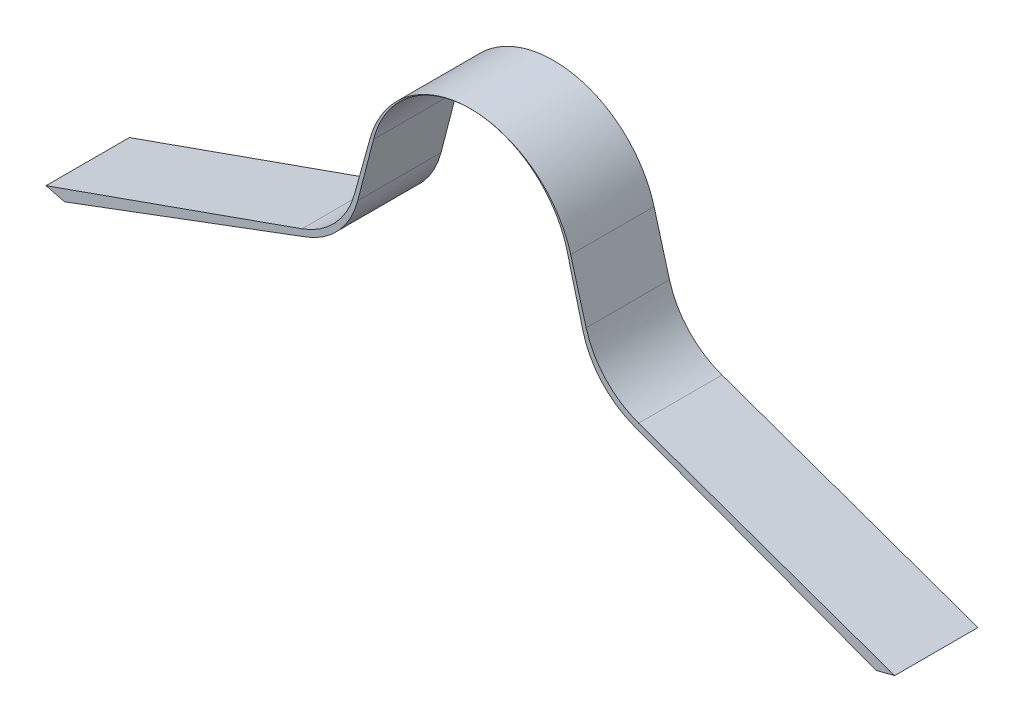
ISO-10303-21;
HEADER;
FILE_DESCRIPTION(('STEP AP214'),'2;1');
FILE_NAME('part.step','',(''),(''),'','','');
FILE_SCHEMA(('AUTOMOTIVE_DESIGN { 1 0 10303 214 1 1 1 1 }'));
ENDSEC;
DATA;
#1=APPLICATION_CONTEXT('core data for automotive mechanical design processes');
#2=APPLICATION_PROTOCOL_DEFINITION('international standard','automotive_design',2000,#1);
#3=PRODUCT_CONTEXT('',#1,'mechanical');
#4=PRODUCT('Part','Part','',(#3));
#5=PRODUCT_RELATED_PRODUCT_CATEGORY('part','',(#4));
#6=PRODUCT_DEFINITION_FORMATION('','',#4);
#7=PRODUCT_DEFINITION_CONTEXT('part definition',#1,'design');
#8=PRODUCT_DEFINITION('design','',#6,#7);
#9=PRODUCT_DEFINITION_SHAPE('','',#8);
#10=(LENGTH_UNIT() NAMED_UNIT(*) SI_UNIT(.MILLI.,.METRE.));
#11=(NAMED_UNIT(*) PLANE_ANGLE_UNIT() SI_UNIT($,.RADIAN.));
#12=(NAMED_UNIT(*) SI_UNIT($,.STERADIAN.) SOLID_ANGLE_UNIT());
#13=UNCERTAINTY_MEASURE_WITH_UNIT(LENGTH_MEASURE(1.E-05),#10,'distance_accuracy_value','');
#14=(GEOMETRIC_REPRESENTATION_CONTEXT(3) GLOBAL_UNCERTAINTY_ASSIGNED_CONTEXT((#13)) GLOBAL_UNIT_ASSIGNED_CONTEXT((#10,
#11,#12)) REPRESENTATION_CONTEXT('',''));
#15=CARTESIAN_POINT('',(0.,0.,0.));
#16=DIRECTION('',(0.,0.,1.));
#17=DIRECTION('',(1.,0.,0.));
#18=AXIS2_PLACEMENT_3D('',#15,#16,#17);
#19=CARTESIAN_POINT('',(-5.09125852276451,-1.06644045058442,1.));
#20=DIRECTION('',(0.246007151261733,0.969268013259535,0.));
#21=DIRECTION('',(-0.969268013259535,0.246007151261733,0.));
#22=AXIS2_PLACEMENT_3D('',#19,#20,#21);
#23=PLANE('',#22);
#24=DIRECTION('',(0.969268013259535,-0.246007151261733,0.));
#25=VECTOR('',#24,1.);
#26=CARTESIAN_POINT('',(-5.09125852276451,-1.06644045058442,0.));
#27=LINE('',#26,#25);
#28=CARTESIAN_POINT('',(-5.09125852276451,-1.06644045058442,0.));
#29=VERTEX_POINT('',#28);
#30=CARTESIAN_POINT('',(-4.86843377044591,-1.12299496574288,0.));
#31=VERTEX_POINT('',#30);
#32=EDGE_CURVE('E176',#29,#31,#27,.T.);
#33=ORIENTED_EDGE('',*,*,#32,.T.);
#34=DIRECTION('',(0.,0.,-1.));
#35=VECTOR('',#34,1.);
#36=CARTESIAN_POINT('',(-4.86843377044591,-1.12299496574288,1.));
#37=LINE('',#36,#35);
#38=CARTESIAN_POINT('',(-4.86843377044591,-1.12299496574288,1.));
#39=VERTEX_POINT('',#38);
#40=EDGE_CURVE('E11',#39,#31,#37,.T.);
#41=ORIENTED_EDGE('',*,*,#40,.F.);
#42=DIRECTION('',(0.969268013259535,-0.246007151261733,0.));
#43=VECTOR('',#42,1.);
#44=CARTESIAN_POINT('',(-5.09125852276451,-1.06644045058442,1.));
#45=LINE('',#44,#43);
#46=CARTESIAN_POINT('',(-5.09125852276451,-1.06644045058442,1.));
#47=VERTEX_POINT('',#46);
#48=EDGE_CURVE('E206',#47,#39,#45,.T.);
#49=ORIENTED_EDGE('',*,*,#48,.F.);
#50=DIRECTION('',(0.,0.,-1.));
#51=VECTOR('',#50,1.);
#52=CARTESIAN_POINT('',(-5.09125852276451,-1.06644045058442,1.));
#53=LINE('',#52,#51);
#54=EDGE_CURVE('E172',#47,#29,#53,.T.);
#55=ORIENTED_EDGE('',*,*,#54,.T.);
#56=EDGE_LOOP('',(#33,#41,#49,#55));
#57=FACE_BOUND('',#56,.T.);
#58=ADVANCED_FACE('F32',(#57),#23,.F.);
#59=CARTESIAN_POINT('',(-4.86843377044591,-1.12299496574288,1.));
#60=DIRECTION('',(-0.350207381259472,0.936672189248396,0.));
#61=DIRECTION('',(-0.936672189248396,-0.350207381259472,0.));
#62=AXIS2_PLACEMENT_3D('',#59,#60,#61);
#63=PLANE('',#62);
#64=DIRECTION('',(0.936672189248396,0.350207381259472,0.));
#65=VECTOR('',#64,1.);
#66=CARTESIAN_POINT('',(-4.86843377044591,-1.12299496574288,0.));
#67=LINE('',#66,#65);
#68=CARTESIAN_POINT('',(-1.96901480998741,-0.0389466370196774,0.));
#69=VERTEX_POINT('',#68);
#70=EDGE_CURVE('E179',#31,#69,#67,.T.);
#71=ORIENTED_EDGE('',*,*,#70,.T.);
#72=DIRECTION('',(0.,0.,-1.));
#73=VECTOR('',#72,1.);
#74=CARTESIAN_POINT('',(-1.96901480998741,-0.0389466370196774,1.));
#75=LINE('',#74,#73);
#76=CARTESIAN_POINT('',(-1.96901480998741,-0.0389466370196774,1.));
#77=VERTEX_POINT('',#76);
#78=EDGE_CURVE('E40',#77,#69,#75,.T.);
#79=ORIENTED_EDGE('',*,*,#78,.F.);
#80=DIRECTION('',(0.936672189248396,0.350207381259472,0.));
#81=VECTOR('',#80,1.);
#82=CARTESIAN_POINT('',(-4.86843377044591,-1.12299496574288,1.));
#83=LINE('',#82,#81);
#84=EDGE_CURVE('E115',#39,#77,#83,.T.);
#85=ORIENTED_EDGE('',*,*,#84,.F.);
#86=ORIENTED_EDGE('',*,*,#40,.T.);
#87=EDGE_LOOP('',(#71,#79,#85,#86));
#88=FACE_BOUND('',#87,.T.);
#89=ADVANCED_FACE('F304',(#88),#63,.F.);
#90=CARTESIAN_POINT('',(-2.31922219124688,0.897725552228719,1.));
#91=DIRECTION('',(0.,0.,-1.));
#92=DIRECTION('',(-1.,0.,0.));
#93=AXIS2_PLACEMENT_3D('',#90,#91,#92);
#94=CYLINDRICAL_SURFACE('',#93,1.);
#95=CARTESIAN_POINT('',(-2.31922219124688,0.897725552228719,0.));
#96=DIRECTION('',(0.,0.,1.));
#97=DIRECTION('',(-1.,0.,0.));
#98=AXIS2_PLACEMENT_3D('',#95,#96,#97);
#99=CIRCLE('',#98,1.);
#100=CARTESIAN_POINT('',(-1.35107455086877,0.647345548174284,0.));
#101=VERTEX_POINT('',#100);
#102=EDGE_CURVE('E181',#69,#101,#99,.T.);
#103=ORIENTED_EDGE('',*,*,#102,.T.);
#104=DIRECTION('',(0.,0.,-1.));
#105=VECTOR('',#104,1.);
#106=CARTESIAN_POINT('',(-1.35107455086877,0.647345548174284,1.));
#107=LINE('',#106,#105);
#108=CARTESIAN_POINT('',(-1.35107455086877,0.647345548174284,1.));
#109=VERTEX_POINT('',#108);
#110=EDGE_CURVE('E237',#109,#101,#107,.T.);
#111=ORIENTED_EDGE('',*,*,#110,.F.);
#112=CARTESIAN_POINT('',(-2.31922219124688,0.897725552228719,1.));
#113=DIRECTION('',(0.,0.,1.));
#114=DIRECTION('',(-1.,0.,0.));
#115=AXIS2_PLACEMENT_3D('',#112,#113,#114);
#116=CIRCLE('',#115,1.);
#117=EDGE_CURVE('E245',#77,#109,#116,.T.);
#118=ORIENTED_EDGE('',*,*,#117,.F.);
#119=ORIENTED_EDGE('',*,*,#78,.T.);
#120=EDGE_LOOP('',(#103,#111,#118,#119));
#121=FACE_BOUND('',#120,.T.);
#122=ADVANCED_FACE('F243',(#121),#94,.T.);
#123=CARTESIAN_POINT('',(-1.35107455086877,0.647345548174284,1.));
#124=DIRECTION('',(-0.968147640378109,0.250380004054435,0.));
#125=DIRECTION('',(-0.250380004054435,-0.96814764037811,0.));
#126=AXIS2_PLACEMENT_3D('',#123,#124,#125);
#127=PLANE('',#126);
#128=DIRECTION('',(0.250380004054435,0.96814764037811,0.));
#129=VECTOR('',#128,1.);
#130=CARTESIAN_POINT('',(-1.35107455086877,0.647345548174284,0.));
#131=LINE('',#130,#129);
#132=CARTESIAN_POINT('',(-1.16177716845373,1.3793042155886,0.));
#133=VERTEX_POINT('',#132);
#134=EDGE_CURVE('E183',#101,#133,#131,.T.);
#135=ORIENTED_EDGE('',*,*,#134,.T.);
#136=DIRECTION('',(0.,0.,-1.));
#137=VECTOR('',#136,1.);
#138=CARTESIAN_POINT('',(-1.16177716845373,1.3793042155886,1.));
#139=LINE('',#138,#137);
#140=CARTESIAN_POINT('',(-1.16177716845373,1.3793042155886,1.));
#141=VERTEX_POINT('',#140);
#142=EDGE_CURVE('E234',#141,#133,#139,.T.);
#143=ORIENTED_EDGE('',*,*,#142,.F.);
#144=DIRECTION('',(0.250380004054435,0.96814764037811,0.));
#145=VECTOR('',#144,1.);
#146=CARTESIAN_POINT('',(-1.35107455086877,0.647345548174284,1.));
#147=LINE('',#146,#145);
#148=EDGE_CURVE('E263',#109,#141,#147,.T.);
#149=ORIENTED_EDGE('',*,*,#148,.F.);
#150=ORIENTED_EDGE('',*,*,#110,.T.);
#151=EDGE_LOOP('',(#135,#143,#149,#150));
#152=FACE_BOUND('',#151,.T.);
#153=ADVANCED_FACE('F254',(#152),#127,.F.);
#154=CARTESIAN_POINT('',(0.,1.07884821072328,1.));
#155=DIRECTION('',(0.,0.,-1.));
#156=DIRECTION('',(-1.,0.,0.));
#157=AXIS2_PLACEMENT_3D('',#154,#155,#156);
#158=CYLINDRICAL_SURFACE('',#157,1.2);
#159=CARTESIAN_POINT('',(0.,1.07884821072328,0.));
#160=DIRECTION('',(0.,0.,-1.));
#161=DIRECTION('',(-1.,0.,0.));
#162=AXIS2_PLACEMENT_3D('',#159,#160,#161);
#163=CIRCLE('',#162,1.2);
#164=CARTESIAN_POINT('',(1.16177716845373,1.3793042155886,0.));
#165=VERTEX_POINT('',#164);
#166=EDGE_CURVE('E185',#133,#165,#163,.T.);
#167=ORIENTED_EDGE('',*,*,#166,.T.);
#168=DIRECTION('',(0.,0.,-1.));
#169=VECTOR('',#168,1.);
#170=CARTESIAN_POINT('',(1.16177716845373,1.3793042155886,1.));
#171=LINE('',#170,#169);
#172=CARTESIAN_POINT('',(1.16177716845373,1.3793042155886,1.));
#173=VERTEX_POINT('',#172);
#174=EDGE_CURVE('E231',#173,#165,#171,.T.);
#175=ORIENTED_EDGE('',*,*,#174,.F.);
#176=CARTESIAN_POINT('',(0.,1.07884821072328,1.));
#177=DIRECTION('',(0.,0.,-1.));
#178=DIRECTION('',(-1.,0.,0.));
#179=AXIS2_PLACEMENT_3D('',#176,#177,#178);
#180=CIRCLE('',#179,1.2);
#181=EDGE_CURVE('E260',#141,#173,#180,.T.);
#182=ORIENTED_EDGE('',*,*,#181,.F.);
#183=ORIENTED_EDGE('',*,*,#142,.T.);
#184=EDGE_LOOP('',(#167,#175,#182,#183));
#185=FACE_BOUND('',#184,.T.);
#186=ADVANCED_FACE('F258',(#185),#158,.F.);
#187=CARTESIAN_POINT('',(1.35107455086877,0.647345548174284,1.));
#188=DIRECTION('',(0.96814764037811,0.250380004054435,0.));
#189=DIRECTION('',(-0.250380004054435,0.96814764037811,0.));
#190=AXIS2_PLACEMENT_3D('',#187,#188,#189);
#191=PLANE('',#190);
#192=DIRECTION('',(0.250380004054435,-0.96814764037811,0.));
#193=VECTOR('',#192,1.);
#194=CARTESIAN_POINT('',(1.35107455086877,0.647345548174284,0.));
#195=LINE('',#194,#193);
#196=CARTESIAN_POINT('',(1.35107455086877,0.647345548174284,0.));
#197=VERTEX_POINT('',#196);
#198=EDGE_CURVE('E187',#165,#197,#195,.T.);
#199=ORIENTED_EDGE('',*,*,#198,.T.);
#200=DIRECTION('',(0.,0.,-1.));
#201=VECTOR('',#200,1.);
#202=CARTESIAN_POINT('',(1.35107455086877,0.647345548174284,1.));
#203=LINE('',#202,#201);
#204=CARTESIAN_POINT('',(1.35107455086877,0.647345548174284,1.));
#205=VERTEX_POINT('',#204);
#206=EDGE_CURVE('E228',#205,#197,#203,.T.);
#207=ORIENTED_EDGE('',*,*,#206,.F.);
#208=DIRECTION('',(0.250380004054435,-0.96814764037811,0.));
#209=VECTOR('',#208,1.);
#210=CARTESIAN_POINT('',(1.35107455086877,0.647345548174284,1.));
#211=LINE('',#210,#209);
#212=EDGE_CURVE('E262',#173,#205,#211,.T.);
#213=ORIENTED_EDGE('',*,*,#212,.F.);
#214=ORIENTED_EDGE('',*,*,#174,.T.);
#215=EDGE_LOOP('',(#199,#207,#213,#214));
#216=FACE_BOUND('',#215,.T.);
#217=ADVANCED_FACE('F317',(#216),#191,.F.);
#218=CARTESIAN_POINT('',(2.31922219124688,0.897725552228719,1.));
#219=DIRECTION('',(0.,0.,-1.));
#220=DIRECTION('',(-1.,0.,0.));
#221=AXIS2_PLACEMENT_3D('',#218,#219,#220);
#222=CYLINDRICAL_SURFACE('',#221,1.);
#223=CARTESIAN_POINT('',(2.31922219124688,0.897725552228719,0.));
#224=DIRECTION('',(0.,0.,1.));
#225=DIRECTION('',(1.,0.,0.));
#226=AXIS2_PLACEMENT_3D('',#223,#224,#225);
#227=CIRCLE('',#226,1.);
#228=CARTESIAN_POINT('',(1.96901480998741,-0.0389466370196772,0.));
#229=VERTEX_POINT('',#228);
#230=EDGE_CURVE('E189',#197,#229,#227,.T.);
#231=ORIENTED_EDGE('',*,*,#230,.T.);
#232=DIRECTION('',(0.,0.,-1.));
#233=VECTOR('',#232,1.);
#234=CARTESIAN_POINT('',(1.96901480998741,-0.0389466370196772,1.));
#235=LINE('',#234,#233);
#236=CARTESIAN_POINT('',(1.96901480998741,-0.0389466370196772,1.));
#237=VERTEX_POINT('',#236);
#238=EDGE_CURVE('E225',#237,#229,#235,.T.);
#239=ORIENTED_EDGE('',*,*,#238,.F.);
#240=CARTESIAN_POINT('',(2.31922219124688,0.897725552228719,1.));
#241=DIRECTION('',(0.,0.,1.));
#242=DIRECTION('',(1.,0.,0.));
#243=AXIS2_PLACEMENT_3D('',#240,#241,#242);
#244=CIRCLE('',#243,1.);
#245=EDGE_CURVE('E265',#205,#237,#244,.T.);
#246=ORIENTED_EDGE('',*,*,#245,.F.);
#247=ORIENTED_EDGE('',*,*,#206,.T.);
#248=EDGE_LOOP('',(#231,#239,#246,#247));
#249=FACE_BOUND('',#248,.T.);
#250=ADVANCED_FACE('F320',(#249),#222,.T.);
#251=CARTESIAN_POINT('',(4.86843377044591,-1.12299496574288,1.));
#252=DIRECTION('',(0.350207381259472,0.936672189248396,0.));
#253=DIRECTION('',(-0.936672189248396,0.350207381259472,0.));
#254=AXIS2_PLACEMENT_3D('',#251,#252,#253);
#255=PLANE('',#254);
#256=DIRECTION('',(0.936672189248396,-0.350207381259472,0.));
#257=VECTOR('',#256,1.);
#258=CARTESIAN_POINT('',(4.86843377044591,-1.12299496574288,0.));
#259=LINE('',#258,#257);
#260=CARTESIAN_POINT('',(4.86843377044591,-1.12299496574288,0.));
#261=VERTEX_POINT('',#260);
#262=EDGE_CURVE('E191',#229,#261,#259,.T.);
#263=ORIENTED_EDGE('',*,*,#262,.T.);
#264=DIRECTION('',(0.,0.,-1.));
#265=VECTOR('',#264,1.);
#266=CARTESIAN_POINT('',(4.86843377044591,-1.12299496574288,1.));
#267=LINE('',#266,#265);
#268=CARTESIAN_POINT('',(4.86843377044591,-1.12299496574288,1.));
#269=VERTEX_POINT('',#268);
#270=EDGE_CURVE('E222',#269,#261,#267,.T.);
#271=ORIENTED_EDGE('',*,*,#270,.F.);
#272=DIRECTION('',(0.936672189248396,-0.350207381259472,0.));
#273=VECTOR('',#272,1.);
#274=CARTESIAN_POINT('',(4.86843377044591,-1.12299496574288,1.));
#275=LINE('',#274,#273);
#276=EDGE_CURVE('E271',#237,#269,#275,.T.);
#277=ORIENTED_EDGE('',*,*,#276,.F.);
#278=ORIENTED_EDGE('',*,*,#238,.T.);
#279=EDGE_LOOP('',(#263,#271,#277,#278));
#280=FACE_BOUND('',#279,.T.);
#281=ADVANCED_FACE('F324',(#280),#255,.F.);
#282=CARTESIAN_POINT('',(5.09125852276451,-1.06644045058442,1.));
#283=DIRECTION('',(-0.246007151261736,0.969268013259535,0.));
#284=DIRECTION('',(-0.969268013259535,-0.246007151261736,0.));
#285=AXIS2_PLACEMENT_3D('',#282,#283,#284);
#286=PLANE('',#285);
#287=DIRECTION('',(0.969268013259534,0.246007151261736,0.));
#288=VECTOR('',#287,1.);
#289=CARTESIAN_POINT('',(5.09125852276451,-1.06644045058442,0.));
#290=LINE('',#289,#288);
#291=CARTESIAN_POINT('',(5.09125852276451,-1.06644045058442,0.));
#292=VERTEX_POINT('',#291);
#293=EDGE_CURVE('E193',#261,#292,#290,.T.);
#294=ORIENTED_EDGE('',*,*,#293,.T.);
#295=DIRECTION('',(0.,0.,-1.));
#296=VECTOR('',#295,1.);
#297=CARTESIAN_POINT('',(5.09125852276451,-1.06644045058442,1.));
#298=LINE('',#297,#296);
#299=CARTESIAN_POINT('',(5.09125852276451,-1.06644045058442,1.));
#300=VERTEX_POINT('',#299);
#301=EDGE_CURVE('E219',#300,#292,#298,.T.);
#302=ORIENTED_EDGE('',*,*,#301,.F.);
#303=DIRECTION('',(0.969268013259534,0.246007151261736,0.));
#304=VECTOR('',#303,1.);
#305=CARTESIAN_POINT('',(5.09125852276451,-1.06644045058442,1.));
#306=LINE('',#305,#304);
#307=EDGE_CURVE('E273',#269,#300,#306,.T.);
#308=ORIENTED_EDGE('',*,*,#307,.F.);
#309=ORIENTED_EDGE('',*,*,#270,.T.);
#310=EDGE_LOOP('',(#294,#302,#308,#309));
#311=FACE_BOUND('',#310,.T.);
#312=ADVANCED_FACE('F328',(#311),#286,.F.);
#313=CARTESIAN_POINT('',(5.09125852276451,-1.06644045058442,1.));
#314=DIRECTION('',(-0.333806859233775,-0.942641491092177,0.));
#315=DIRECTION('',(0.942641491092177,-0.333806859233775,0.));
#316=AXIS2_PLACEMENT_3D('',#313,#314,#315);
#317=PLANE('',#316);
#318=DIRECTION('',(-0.942641491092177,0.333806859233775,0.));
#319=VECTOR('',#318,1.);
#320=CARTESIAN_POINT('',(5.09125852276451,-1.06644045058442,0.));
#321=LINE('',#320,#319);
#322=CARTESIAN_POINT('',(2.01937068187544,0.0213720866056427,0.));
#323=VERTEX_POINT('',#322);
#324=EDGE_CURVE('E195',#292,#323,#321,.T.);
#325=ORIENTED_EDGE('',*,*,#324,.T.);
#326=DIRECTION('',(0.,0.,-1.));
#327=VECTOR('',#326,1.);
#328=CARTESIAN_POINT('',(2.01937068187544,0.0213720866056427,1.));
#329=LINE('',#328,#327);
#330=CARTESIAN_POINT('',(2.01937068187544,0.0213720866056427,1.));
#331=VERTEX_POINT('',#330);
#332=EDGE_CURVE('E216',#331,#323,#329,.T.);
#333=ORIENTED_EDGE('',*,*,#332,.F.);
#334=DIRECTION('',(-0.942641491092177,0.333806859233775,0.));
#335=VECTOR('',#334,1.);
#336=CARTESIAN_POINT('',(5.09125852276451,-1.06644045058442,1.));
#337=LINE('',#336,#335);
#338=EDGE_CURVE('E275',#300,#331,#337,.T.);
#339=ORIENTED_EDGE('',*,*,#338,.F.);
#340=ORIENTED_EDGE('',*,*,#301,.T.);
#341=EDGE_LOOP('',(#325,#333,#339,#340));
#342=FACE_BOUND('',#341,.T.);
#343=ADVANCED_FACE('F332',(#342),#317,.F.);
#344=CARTESIAN_POINT('',(2.35317754110922,0.96401357769782,1.));
#345=DIRECTION('',(0.,0.,-1.));
#346=DIRECTION('',(-1.,0.,0.));
#347=AXIS2_PLACEMENT_3D('',#344,#345,#346);
#348=CYLINDRICAL_SURFACE('',#347,1.);
#349=CARTESIAN_POINT('',(2.35317754110922,0.96401357769782,0.));
#350=DIRECTION('',(0.,0.,-1.));
#351=DIRECTION('',(1.,0.,0.));
#352=AXIS2_PLACEMENT_3D('',#349,#350,#351);
#353=CIRCLE('',#352,1.);
#354=CARTESIAN_POINT('',(1.38954708790059,0.69677520161957,0.));
#355=VERTEX_POINT('',#354);
#356=EDGE_CURVE('E197',#323,#355,#353,.T.);
#357=ORIENTED_EDGE('',*,*,#356,.T.);
#358=DIRECTION('',(0.,0.,-1.));
#359=VECTOR('',#358,1.);
#360=CARTESIAN_POINT('',(1.38954708790059,0.69677520161957,1.));
#361=LINE('',#360,#359);
#362=CARTESIAN_POINT('',(1.38954708790059,0.69677520161957,1.));
#363=VERTEX_POINT('',#362);
#364=EDGE_CURVE('E213',#363,#355,#361,.T.);
#365=ORIENTED_EDGE('',*,*,#364,.F.);
#366=CARTESIAN_POINT('',(2.35317754110922,0.96401357769782,1.));
#367=DIRECTION('',(0.,0.,-1.));
#368=DIRECTION('',(1.,0.,0.));
#369=AXIS2_PLACEMENT_3D('',#366,#367,#368);
#370=CIRCLE('',#369,1.);
#371=EDGE_CURVE('E277',#331,#363,#370,.T.);
#372=ORIENTED_EDGE('',*,*,#371,.F.);
#373=ORIENTED_EDGE('',*,*,#332,.T.);
#374=EDGE_LOOP('',(#357,#365,#372,#373));
#375=FACE_BOUND('',#374,.T.);
#376=ADVANCED_FACE('F336',(#375),#348,.F.);
#377=CARTESIAN_POINT('',(1.38954708790059,0.69677520161957,1.));
#378=DIRECTION('',(-0.963630453208625,-0.267238376078251,0.));
#379=DIRECTION('',(0.267238376078251,-0.963630453208625,0.));
#380=AXIS2_PLACEMENT_3D('',#377,#378,#379);
#381=PLANE('',#380);
#382=DIRECTION('',(-0.267238376078251,0.963630453208625,0.));
#383=VECTOR('',#382,1.);
#384=CARTESIAN_POINT('',(1.38954708790059,0.69677520161957,0.));
#385=LINE('',#384,#383);
#386=CARTESIAN_POINT('',(1.20453806651078,1.36389618082109,0.));
#387=VERTEX_POINT('',#386);
#388=EDGE_CURVE('E199',#355,#387,#385,.T.);
#389=ORIENTED_EDGE('',*,*,#388,.T.);
#390=DIRECTION('',(0.,0.,-1.));
#391=VECTOR('',#390,1.);
#392=CARTESIAN_POINT('',(1.20453806651078,1.36389618082109,1.));
#393=LINE('',#392,#391);
#394=CARTESIAN_POINT('',(1.20453806651078,1.36389618082109,1.));
#395=VERTEX_POINT('',#394);
#396=EDGE_CURVE('E210',#395,#387,#393,.T.);
#397=ORIENTED_EDGE('',*,*,#396,.F.);
#398=DIRECTION('',(-0.267238376078251,0.963630453208625,0.));
#399=VECTOR('',#398,1.);
#400=CARTESIAN_POINT('',(1.38954708790059,0.69677520161957,1.));
#401=LINE('',#400,#399);
#402=EDGE_CURVE('E279',#363,#395,#401,.T.);
#403=ORIENTED_EDGE('',*,*,#402,.F.);
#404=ORIENTED_EDGE('',*,*,#364,.T.);
#405=EDGE_LOOP('',(#389,#397,#403,#404));
#406=FACE_BOUND('',#405,.T.);
#407=ADVANCED_FACE('F285',(#406),#381,.F.);
#408=CARTESIAN_POINT('',(0.,1.02984821072328,1.));
#409=DIRECTION('',(0.,0.,-1.));
#410=DIRECTION('',(-1.,0.,0.));
#411=AXIS2_PLACEMENT_3D('',#408,#409,#410);
#412=CYLINDRICAL_SURFACE('',#411,1.25);
#413=CARTESIAN_POINT('',(0.,1.02984821072328,0.));
#414=DIRECTION('',(0.,0.,1.));
#415=DIRECTION('',(-1.,0.,0.));
#416=AXIS2_PLACEMENT_3D('',#413,#414,#415);
#417=CIRCLE('',#416,1.25);
#418=CARTESIAN_POINT('',(-1.20453806651078,1.36389618082109,0.));
#419=VERTEX_POINT('',#418);
#420=EDGE_CURVE('E201',#387,#419,#417,.T.);
#421=ORIENTED_EDGE('',*,*,#420,.T.);
#422=DIRECTION('',(0.,0.,-1.));
#423=VECTOR('',#422,1.);
#424=CARTESIAN_POINT('',(-1.20453806651078,1.36389618082109,1.));
#425=LINE('',#424,#423);
#426=CARTESIAN_POINT('',(-1.20453806651078,1.36389618082109,1.));
#427=VERTEX_POINT('',#426);
#428=EDGE_CURVE('E167',#427,#419,#425,.T.);
#429=ORIENTED_EDGE('',*,*,#428,.F.);
#430=CARTESIAN_POINT('',(0.,1.02984821072328,1.));
#431=DIRECTION('',(0.,0.,1.));
#432=DIRECTION('',(-1.,0.,0.));
#433=AXIS2_PLACEMENT_3D('',#430,#431,#432);
#434=CIRCLE('',#433,1.25);
#435=EDGE_CURVE('E158',#395,#427,#434,.T.);
#436=ORIENTED_EDGE('',*,*,#435,.F.);
#437=ORIENTED_EDGE('',*,*,#396,.T.);
#438=EDGE_LOOP('',(#421,#429,#436,#437));
#439=FACE_BOUND('',#438,.T.);
#440=ADVANCED_FACE('F289',(#439),#412,.T.);
#441=CARTESIAN_POINT('',(-1.38954708790059,0.696775201619569,1.));
#442=DIRECTION('',(0.963630453208625,-0.267238376078251,0.));
#443=DIRECTION('',(0.267238376078251,0.963630453208625,0.));
#444=AXIS2_PLACEMENT_3D('',#441,#442,#443);
#445=PLANE('',#444);
#446=DIRECTION('',(-0.267238376078251,-0.963630453208625,0.));
#447=VECTOR('',#446,1.);
#448=CARTESIAN_POINT('',(-1.38954708790059,0.696775201619569,0.));
#449=LINE('',#448,#447);
#450=CARTESIAN_POINT('',(-1.38954708790059,0.696775201619569,0.));
#451=VERTEX_POINT('',#450);
#452=EDGE_CURVE('E166',#419,#451,#449,.T.);
#453=ORIENTED_EDGE('',*,*,#452,.T.);
#454=DIRECTION('',(0.,0.,-1.));
#455=VECTOR('',#454,1.);
#456=CARTESIAN_POINT('',(-1.38954708790059,0.696775201619569,1.));
#457=LINE('',#456,#455);
#458=CARTESIAN_POINT('',(-1.38954708790059,0.696775201619569,1.));
#459=VERTEX_POINT('',#458);
#460=EDGE_CURVE('E163',#459,#451,#457,.T.);
#461=ORIENTED_EDGE('',*,*,#460,.F.);
#462=DIRECTION('',(-0.267238376078251,-0.963630453208625,0.));
#463=VECTOR('',#462,1.);
#464=CARTESIAN_POINT('',(-1.38954708790059,0.696775201619569,1.));
#465=LINE('',#464,#463);
#466=EDGE_CURVE('E152',#427,#459,#465,.T.);
#467=ORIENTED_EDGE('',*,*,#466,.F.);
#468=ORIENTED_EDGE('',*,*,#428,.T.);
#469=EDGE_LOOP('',(#453,#461,#467,#468));
#470=FACE_BOUND('',#469,.T.);
#471=ADVANCED_FACE('F164',(#470),#445,.F.);
#472=CARTESIAN_POINT('',(-2.35317754110921,0.964013577697819,1.));
#473=DIRECTION('',(0.,0.,-1.));
#474=DIRECTION('',(-1.,0.,0.));
#475=AXIS2_PLACEMENT_3D('',#472,#473,#474);
#476=CYLINDRICAL_SURFACE('',#475,1.);
#477=CARTESIAN_POINT('',(-2.35317754110921,0.964013577697819,0.));
#478=DIRECTION('',(0.,0.,-1.));
#479=DIRECTION('',(-1.,0.,0.));
#480=AXIS2_PLACEMENT_3D('',#477,#478,#479);
#481=CIRCLE('',#480,1.);
#482=CARTESIAN_POINT('',(-2.01937068187544,0.0213720866056428,0.));
#483=VERTEX_POINT('',#482);
#484=EDGE_CURVE('E101',#451,#483,#481,.T.);
#485=ORIENTED_EDGE('',*,*,#484,.T.);
#486=DIRECTION('',(0.,0.,-1.));
#487=VECTOR('',#486,1.);
#488=CARTESIAN_POINT('',(-2.01937068187544,0.0213720866056428,1.));
#489=LINE('',#488,#487);
#490=CARTESIAN_POINT('',(-2.01937068187544,0.0213720866056428,1.));
#491=VERTEX_POINT('',#490);
#492=EDGE_CURVE('E168',#491,#483,#489,.T.);
#493=ORIENTED_EDGE('',*,*,#492,.F.);
#494=CARTESIAN_POINT('',(-2.35317754110921,0.964013577697819,1.));
#495=DIRECTION('',(0.,0.,-1.));
#496=DIRECTION('',(-1.,0.,0.));
#497=AXIS2_PLACEMENT_3D('',#494,#495,#496);
#498=CIRCLE('',#497,1.);
#499=EDGE_CURVE('E156',#459,#491,#498,.T.);
#500=ORIENTED_EDGE('',*,*,#499,.F.);
#501=ORIENTED_EDGE('',*,*,#460,.T.);
#502=EDGE_LOOP('',(#485,#493,#500,#501));
#503=FACE_BOUND('',#502,.T.);
#504=ADVANCED_FACE('F170',(#503),#476,.F.);
#505=CARTESIAN_POINT('',(-5.09125852276451,-1.06644045058442,1.));
#506=DIRECTION('',(0.333806859233776,-0.942641491092177,0.));
#507=DIRECTION('',(0.942641491092177,0.333806859233776,0.));
#508=AXIS2_PLACEMENT_3D('',#505,#506,#507);
#509=PLANE('',#508);
#510=DIRECTION('',(-0.942641491092177,-0.333806859233776,0.));
#511=VECTOR('',#510,1.);
#512=CARTESIAN_POINT('',(-5.09125852276451,-1.06644045058442,0.));
#513=LINE('',#512,#511);
#514=EDGE_CURVE('E107',#483,#29,#513,.T.);
#515=ORIENTED_EDGE('',*,*,#514,.T.);
#516=ORIENTED_EDGE('',*,*,#54,.F.);
#517=DIRECTION('',(-0.942641491092177,-0.333806859233776,0.));
#518=VECTOR('',#517,1.);
#519=CARTESIAN_POINT('',(-5.09125852276451,-1.06644045058442,1.));
#520=LINE('',#519,#518);
#521=EDGE_CURVE('E48',#491,#47,#520,.T.);
#522=ORIENTED_EDGE('',*,*,#521,.F.);
#523=ORIENTED_EDGE('',*,*,#492,.T.);
#524=EDGE_LOOP('',(#515,#516,#522,#523));
#525=FACE_BOUND('',#524,.T.);
#526=ADVANCED_FACE('F293',(#525),#509,.F.);
#527=CARTESIAN_POINT('',(-2.31922219124688,0.897725552228719,1.));
#528=DIRECTION('',(0.,0.,-1.));
#529=DIRECTION('',(-1.,0.,0.));
#530=AXIS2_PLACEMENT_3D('',#527,#528,#529);
#531=PLANE('',#530);
#532=ORIENTED_EDGE('',*,*,#48,.T.);
#533=ORIENTED_EDGE('',*,*,#84,.T.);
#534=ORIENTED_EDGE('',*,*,#117,.T.);
#535=ORIENTED_EDGE('',*,*,#148,.T.);
#536=ORIENTED_EDGE('',*,*,#181,.T.);
#537=ORIENTED_EDGE('',*,*,#212,.T.);
#538=ORIENTED_EDGE('',*,*,#245,.T.);
#539=ORIENTED_EDGE('',*,*,#276,.T.);
#540=ORIENTED_EDGE('',*,*,#307,.T.);
#541=ORIENTED_EDGE('',*,*,#338,.T.);
#542=ORIENTED_EDGE('',*,*,#371,.T.);
#543=ORIENTED_EDGE('',*,*,#402,.T.);
#544=ORIENTED_EDGE('',*,*,#435,.T.);
#545=ORIENTED_EDGE('',*,*,#466,.T.);
#546=ORIENTED_EDGE('',*,*,#499,.T.);
#547=ORIENTED_EDGE('',*,*,#521,.T.);
#548=EDGE_LOOP('',(#532,#533,#534,#535,#536,#537,#538,#539,#540,#541,#542,#543,#544,#545,#546,#547));
#549=FACE_BOUND('',#548,.T.);
#550=ADVANCED_FACE('F154',(#549),#531,.F.);
#551=CARTESIAN_POINT('',(-2.31922219124688,0.897725552228719,0.));
#552=DIRECTION('',(0.,0.,-1.));
#553=DIRECTION('',(-1.,0.,0.));
#554=AXIS2_PLACEMENT_3D('',#551,#552,#553);
#555=PLANE('',#554);
#556=ORIENTED_EDGE('',*,*,#32,.F.);
#557=ORIENTED_EDGE('',*,*,#514,.F.);
#558=ORIENTED_EDGE('',*,*,#484,.F.);
#559=ORIENTED_EDGE('',*,*,#452,.F.);
#560=ORIENTED_EDGE('',*,*,#420,.F.);
#561=ORIENTED_EDGE('',*,*,#388,.F.);
#562=ORIENTED_EDGE('',*,*,#356,.F.);
#563=ORIENTED_EDGE('',*,*,#324,.F.);
#564=ORIENTED_EDGE('',*,*,#293,.F.);
#565=ORIENTED_EDGE('',*,*,#262,.F.);
#566=ORIENTED_EDGE('',*,*,#230,.F.);
#567=ORIENTED_EDGE('',*,*,#198,.F.);
#568=ORIENTED_EDGE('',*,*,#166,.F.);
#569=ORIENTED_EDGE('',*,*,#134,.F.);
#570=ORIENTED_EDGE('',*,*,#102,.F.);
#571=ORIENTED_EDGE('',*,*,#70,.F.);
#572=EDGE_LOOP('',(#556,#557,#558,#559,#560,#561,#562,#563,#564,#565,#566,#567,#568,#569,#570,#571));
#573=FACE_BOUND('',#572,.T.);
#574=ADVANCED_FACE('F249',(#573),#555,.T.);
#575=CLOSED_SHELL('',(#58,#89,#122,#153,#186,#217,#250,#281,#312,#343,#376,#407,#440,#471,#504,
#526,#550,#574));
#576=MANIFOLD_SOLID_BREP('B2',#575);
#577=ADVANCED_BREP_SHAPE_REPRESENTATION('',(#18,#576),#14);
#578=SHAPE_DEFINITION_REPRESENTATION(#9,#577);
ENDSEC;
END-ISO-10303-21;
